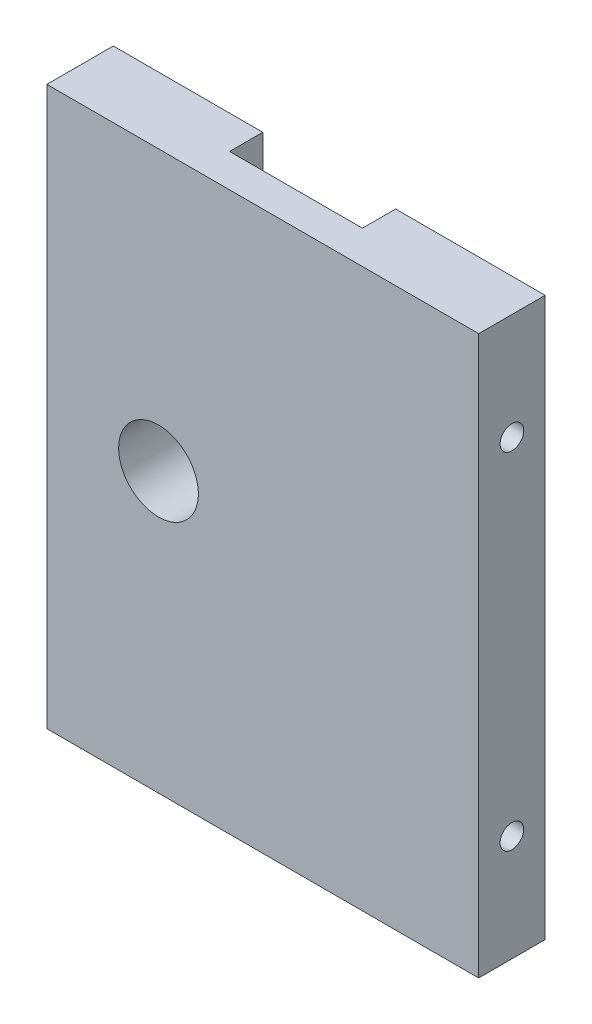
ISO-10303-21;
HEADER;
FILE_DESCRIPTION(('STEP AP214'),'2;1');
FILE_NAME('part.step','',(''),(''),'','','');
FILE_SCHEMA(('AUTOMOTIVE_DESIGN { 1 0 10303 214 1 1 1 1 }'));
ENDSEC;
DATA;
#1=APPLICATION_CONTEXT('core data for automotive mechanical design processes');
#2=APPLICATION_PROTOCOL_DEFINITION('international standard','automotive_design',2000,#1);
#3=PRODUCT_CONTEXT('',#1,'mechanical');
#4=PRODUCT('Part','Part','',(#3));
#5=PRODUCT_RELATED_PRODUCT_CATEGORY('part','',(#4));
#6=PRODUCT_DEFINITION_FORMATION('','',#4);
#7=PRODUCT_DEFINITION_CONTEXT('part definition',#1,'design');
#8=PRODUCT_DEFINITION('design','',#6,#7);
#9=PRODUCT_DEFINITION_SHAPE('','',#8);
#10=(LENGTH_UNIT() NAMED_UNIT(*) SI_UNIT(.MILLI.,.METRE.));
#11=(NAMED_UNIT(*) PLANE_ANGLE_UNIT() SI_UNIT($,.RADIAN.));
#12=(NAMED_UNIT(*) SI_UNIT($,.STERADIAN.) SOLID_ANGLE_UNIT());
#13=UNCERTAINTY_MEASURE_WITH_UNIT(LENGTH_MEASURE(1.E-05),#10,'distance_accuracy_value','');
#14=(GEOMETRIC_REPRESENTATION_CONTEXT(3) GLOBAL_UNCERTAINTY_ASSIGNED_CONTEXT((#13)) GLOBAL_UNIT_ASSIGNED_CONTEXT((#10,
#11,#12)) REPRESENTATION_CONTEXT('',''));
#15=CARTESIAN_POINT('',(0.,0.,0.));
#16=DIRECTION('',(0.,0.,1.));
#17=DIRECTION('',(1.,0.,0.));
#18=AXIS2_PLACEMENT_3D('',#15,#16,#17);
#19=CARTESIAN_POINT('',(0.,42.,5.));
#20=DIRECTION('',(0.,-1.,0.));
#21=DIRECTION('',(0.,0.,-1.));
#22=AXIS2_PLACEMENT_3D('',#19,#20,#21);
#23=PLANE('',#22);
#24=DIRECTION('',(0.,0.,-1.));
#25=VECTOR('',#24,1.);
#26=CARTESIAN_POINT('',(21.25,42.,2.5));
#27=LINE('',#26,#25);
#28=CARTESIAN_POINT('',(21.25,42.,2.5));
#29=VERTEX_POINT('',#28);
#30=CARTESIAN_POINT('',(21.25,42.,0.));
#31=VERTEX_POINT('',#30);
#32=EDGE_CURVE('E158',#29,#31,#27,.T.);
#33=ORIENTED_EDGE('',*,*,#32,.F.);
#34=DIRECTION('',(1.,0.,0.));
#35=VECTOR('',#34,1.);
#36=CARTESIAN_POINT('',(0.,42.,2.5));
#37=LINE('',#36,#35);
#38=CARTESIAN_POINT('',(11.25,42.,2.5));
#39=VERTEX_POINT('',#38);
#40=EDGE_CURVE('E143',#39,#29,#37,.T.);
#41=ORIENTED_EDGE('',*,*,#40,.F.);
#42=DIRECTION('',(0.,0.,-1.));
#43=VECTOR('',#42,1.);
#44=CARTESIAN_POINT('',(11.25,42.,2.5));
#45=LINE('',#44,#43);
#46=CARTESIAN_POINT('',(11.25,42.,0.));
#47=VERTEX_POINT('',#46);
#48=EDGE_CURVE('E161',#39,#47,#45,.T.);
#49=ORIENTED_EDGE('',*,*,#48,.T.);
#50=DIRECTION('',(-1.,0.,0.));
#51=VECTOR('',#50,1.);
#52=CARTESIAN_POINT('',(0.,42.,0.));
#53=LINE('',#52,#51);
#54=CARTESIAN_POINT('',(0.,42.,0.));
#55=VERTEX_POINT('',#54);
#56=EDGE_CURVE('E87',#47,#55,#53,.T.);
#57=ORIENTED_EDGE('',*,*,#56,.T.);
#58=DIRECTION('',(0.,0.,-1.));
#59=VECTOR('',#58,1.);
#60=CARTESIAN_POINT('',(0.,42.,5.));
#61=LINE('',#60,#59);
#62=CARTESIAN_POINT('',(0.,42.,5.));
#63=VERTEX_POINT('',#62);
#64=EDGE_CURVE('E201',#63,#55,#61,.T.);
#65=ORIENTED_EDGE('',*,*,#64,.F.);
#66=DIRECTION('',(-1.,0.,0.));
#67=VECTOR('',#66,1.);
#68=CARTESIAN_POINT('',(0.,42.,5.));
#69=LINE('',#68,#67);
#70=CARTESIAN_POINT('',(32.5,42.,5.));
#71=VERTEX_POINT('',#70);
#72=EDGE_CURVE('E66',#71,#63,#69,.T.);
#73=ORIENTED_EDGE('',*,*,#72,.F.);
#74=DIRECTION('',(0.,0.,-1.));
#75=VECTOR('',#74,1.);
#76=CARTESIAN_POINT('',(32.5,42.,5.));
#77=LINE('',#76,#75);
#78=CARTESIAN_POINT('',(32.5,42.,0.));
#79=VERTEX_POINT('',#78);
#80=EDGE_CURVE('E211',#71,#79,#77,.T.);
#81=ORIENTED_EDGE('',*,*,#80,.T.);
#82=EDGE_CURVE('E196',#79,#31,#53,.T.);
#83=ORIENTED_EDGE('',*,*,#82,.T.);
#84=EDGE_LOOP('',(#33,#41,#49,#57,#65,#73,#81,#83));
#85=FACE_BOUND('',#84,.T.);
#86=ADVANCED_FACE('F42',(#85),#23,.F.);
#87=CARTESIAN_POINT('',(0.,0.,0.));
#88=DIRECTION('',(0.,0.,-1.));
#89=DIRECTION('',(-1.,0.,0.));
#90=AXIS2_PLACEMENT_3D('',#87,#88,#89);
#91=PLANE('',#90);
#92=CARTESIAN_POINT('',(8.4,21.,0.));
#93=DIRECTION('',(0.,0.,-1.));
#94=DIRECTION('',(-1.,0.,0.));
#95=AXIS2_PLACEMENT_3D('',#92,#93,#94);
#96=CIRCLE('',#95,3.);
#97=CARTESIAN_POINT('',(5.4,21.,0.));
#98=VERTEX_POINT('',#97);
#99=EDGE_CURVE('E160',#98,#98,#96,.T.);
#100=ORIENTED_EDGE('',*,*,#99,.F.);
#101=EDGE_LOOP('',(#100));
#102=FACE_BOUND('',#101,.T.);
#103=DIRECTION('',(1.,0.,0.));
#104=VECTOR('',#103,1.);
#105=CARTESIAN_POINT('',(0.,35.5,0.));
#106=LINE('',#105,#104);
#107=CARTESIAN_POINT('',(11.25,35.5,0.));
#108=VERTEX_POINT('',#107);
#109=CARTESIAN_POINT('',(21.25,35.5,0.));
#110=VERTEX_POINT('',#109);
#111=EDGE_CURVE('E151',#108,#110,#106,.T.);
#112=ORIENTED_EDGE('',*,*,#111,.T.);
#113=DIRECTION('',(0.,1.,0.));
#114=VECTOR('',#113,1.);
#115=CARTESIAN_POINT('',(21.25,0.,0.));
#116=LINE('',#115,#114);
#117=EDGE_CURVE('E57',#110,#31,#116,.T.);
#118=ORIENTED_EDGE('',*,*,#117,.T.);
#119=ORIENTED_EDGE('',*,*,#82,.F.);
#120=DIRECTION('',(0.,1.,0.));
#121=VECTOR('',#120,1.);
#122=CARTESIAN_POINT('',(32.5,0.,0.));
#123=LINE('',#122,#121);
#124=CARTESIAN_POINT('',(32.5,0.,0.));
#125=VERTEX_POINT('',#124);
#126=EDGE_CURVE('E206',#125,#79,#123,.T.);
#127=ORIENTED_EDGE('',*,*,#126,.F.);
#128=DIRECTION('',(1.,0.,0.));
#129=VECTOR('',#128,1.);
#130=CARTESIAN_POINT('',(0.,0.,0.));
#131=LINE('',#130,#129);
#132=CARTESIAN_POINT('',(0.,0.,0.));
#133=VERTEX_POINT('',#132);
#134=EDGE_CURVE('E204',#133,#125,#131,.T.);
#135=ORIENTED_EDGE('',*,*,#134,.F.);
#136=DIRECTION('',(0.,-1.,0.));
#137=VECTOR('',#136,1.);
#138=CARTESIAN_POINT('',(0.,0.,0.));
#139=LINE('',#138,#137);
#140=EDGE_CURVE('E193',#55,#133,#139,.T.);
#141=ORIENTED_EDGE('',*,*,#140,.F.);
#142=ORIENTED_EDGE('',*,*,#56,.F.);
#143=DIRECTION('',(0.,-1.,0.));
#144=VECTOR('',#143,1.);
#145=CARTESIAN_POINT('',(11.25,0.,0.));
#146=LINE('',#145,#144);
#147=EDGE_CURVE('E148',#47,#108,#146,.T.);
#148=ORIENTED_EDGE('',*,*,#147,.T.);
#149=EDGE_LOOP('',(#112,#118,#119,#127,#135,#141,#142,#148));
#150=FACE_BOUND('',#149,.T.);
#151=ADVANCED_FACE('F221',(#102,#150),#91,.T.);
#152=CARTESIAN_POINT('',(0.,0.,5.));
#153=DIRECTION('',(1.,0.,0.));
#154=DIRECTION('',(0.,0.,-1.));
#155=AXIS2_PLACEMENT_3D('',#152,#153,#154);
#156=PLANE('',#155);
#157=CARTESIAN_POINT('',(0.,34.,2.5));
#158=DIRECTION('',(-1.,0.,0.));
#159=DIRECTION('',(0.,0.,1.));
#160=AXIS2_PLACEMENT_3D('',#157,#158,#159);
#161=CIRCLE('',#160,0.889000000000001);
#162=CARTESIAN_POINT('',(0.,34.,3.389));
#163=VERTEX_POINT('',#162);
#164=EDGE_CURVE('E181',#163,#163,#161,.T.);
#165=ORIENTED_EDGE('',*,*,#164,.F.);
#166=EDGE_LOOP('',(#165));
#167=FACE_BOUND('',#166,.T.);
#168=CARTESIAN_POINT('',(0.,8.,2.5));
#169=DIRECTION('',(-1.,0.,0.));
#170=DIRECTION('',(0.,0.,1.));
#171=AXIS2_PLACEMENT_3D('',#168,#169,#170);
#172=CIRCLE('',#171,0.888999999999999);
#173=CARTESIAN_POINT('',(0.,8.,3.389));
#174=VERTEX_POINT('',#173);
#175=EDGE_CURVE('E187',#174,#174,#172,.T.);
#176=ORIENTED_EDGE('',*,*,#175,.F.);
#177=EDGE_LOOP('',(#176));
#178=FACE_BOUND('',#177,.T.);
#179=ORIENTED_EDGE('',*,*,#140,.T.);
#180=DIRECTION('',(0.,0.,-1.));
#181=VECTOR('',#180,1.);
#182=CARTESIAN_POINT('',(0.,0.,5.));
#183=LINE('',#182,#181);
#184=CARTESIAN_POINT('',(0.,0.,5.));
#185=VERTEX_POINT('',#184);
#186=EDGE_CURVE('E11',#185,#133,#183,.T.);
#187=ORIENTED_EDGE('',*,*,#186,.F.);
#188=DIRECTION('',(0.,-1.,0.));
#189=VECTOR('',#188,1.);
#190=CARTESIAN_POINT('',(0.,0.,5.));
#191=LINE('',#190,#189);
#192=EDGE_CURVE('E194',#63,#185,#191,.T.);
#193=ORIENTED_EDGE('',*,*,#192,.F.);
#194=ORIENTED_EDGE('',*,*,#64,.T.);
#195=EDGE_LOOP('',(#179,#187,#193,#194));
#196=FACE_BOUND('',#195,.T.);
#197=ADVANCED_FACE('F44',(#167,#178,#196),#156,.F.);
#198=CARTESIAN_POINT('',(0.,0.,5.));
#199=DIRECTION('',(0.,1.,0.));
#200=DIRECTION('',(0.,0.,1.));
#201=AXIS2_PLACEMENT_3D('',#198,#199,#200);
#202=PLANE('',#201);
#203=ORIENTED_EDGE('',*,*,#134,.T.);
#204=DIRECTION('',(0.,0.,-1.));
#205=VECTOR('',#204,1.);
#206=CARTESIAN_POINT('',(32.5,0.,5.));
#207=LINE('',#206,#205);
#208=CARTESIAN_POINT('',(32.5,0.,5.));
#209=VERTEX_POINT('',#208);
#210=EDGE_CURVE('E50',#209,#125,#207,.T.);
#211=ORIENTED_EDGE('',*,*,#210,.F.);
#212=DIRECTION('',(1.,0.,0.));
#213=VECTOR('',#212,1.);
#214=CARTESIAN_POINT('',(0.,0.,5.));
#215=LINE('',#214,#213);
#216=EDGE_CURVE('E94',#185,#209,#215,.T.);
#217=ORIENTED_EDGE('',*,*,#216,.F.);
#218=ORIENTED_EDGE('',*,*,#186,.T.);
#219=EDGE_LOOP('',(#203,#211,#217,#218));
#220=FACE_BOUND('',#219,.T.);
#221=ADVANCED_FACE('F238',(#220),#202,.F.);
#222=CARTESIAN_POINT('',(32.5,0.,5.));
#223=DIRECTION('',(-1.,0.,0.));
#224=DIRECTION('',(0.,0.,1.));
#225=AXIS2_PLACEMENT_3D('',#222,#223,#224);
#226=PLANE('',#225);
#227=CARTESIAN_POINT('',(32.5,34.,2.5));
#228=DIRECTION('',(1.,0.,0.));
#229=DIRECTION('',(0.,0.,-1.));
#230=AXIS2_PLACEMENT_3D('',#227,#228,#229);
#231=CIRCLE('',#230,0.888999999999987);
#232=CARTESIAN_POINT('',(32.5,34.,1.61100000000001));
#233=VERTEX_POINT('',#232);
#234=EDGE_CURVE('E167',#233,#233,#231,.T.);
#235=ORIENTED_EDGE('',*,*,#234,.F.);
#236=EDGE_LOOP('',(#235));
#237=FACE_BOUND('',#236,.T.);
#238=CARTESIAN_POINT('',(32.5,8.,2.5));
#239=DIRECTION('',(1.,0.,0.));
#240=DIRECTION('',(0.,0.,-1.));
#241=AXIS2_PLACEMENT_3D('',#238,#239,#240);
#242=CIRCLE('',#241,0.888999999999989);
#243=CARTESIAN_POINT('',(32.5,8.,1.61100000000001));
#244=VERTEX_POINT('',#243);
#245=EDGE_CURVE('E175',#244,#244,#242,.T.);
#246=ORIENTED_EDGE('',*,*,#245,.F.);
#247=EDGE_LOOP('',(#246));
#248=FACE_BOUND('',#247,.T.);
#249=ORIENTED_EDGE('',*,*,#126,.T.);
#250=ORIENTED_EDGE('',*,*,#80,.F.);
#251=DIRECTION('',(0.,1.,0.));
#252=VECTOR('',#251,1.);
#253=CARTESIAN_POINT('',(32.5,0.,5.));
#254=LINE('',#253,#252);
#255=EDGE_CURVE('E198',#209,#71,#254,.T.);
#256=ORIENTED_EDGE('',*,*,#255,.F.);
#257=ORIENTED_EDGE('',*,*,#210,.T.);
#258=EDGE_LOOP('',(#249,#250,#256,#257));
#259=FACE_BOUND('',#258,.T.);
#260=ADVANCED_FACE('F217',(#237,#248,#259),#226,.F.);
#261=CARTESIAN_POINT('',(0.,0.,5.));
#262=DIRECTION('',(0.,0.,-1.));
#263=DIRECTION('',(-1.,0.,0.));
#264=AXIS2_PLACEMENT_3D('',#261,#262,#263);
#265=PLANE('',#264);
#266=CARTESIAN_POINT('',(8.4,21.,5.));
#267=DIRECTION('',(0.,0.,-1.));
#268=DIRECTION('',(-1.,0.,0.));
#269=AXIS2_PLACEMENT_3D('',#266,#267,#268);
#270=CIRCLE('',#269,3.);
#271=CARTESIAN_POINT('',(5.4,21.,5.));
#272=VERTEX_POINT('',#271);
#273=EDGE_CURVE('E164',#272,#272,#270,.T.);
#274=ORIENTED_EDGE('',*,*,#273,.T.);
#275=EDGE_LOOP('',(#274));
#276=FACE_BOUND('',#275,.T.);
#277=ORIENTED_EDGE('',*,*,#192,.T.);
#278=ORIENTED_EDGE('',*,*,#216,.T.);
#279=ORIENTED_EDGE('',*,*,#255,.T.);
#280=ORIENTED_EDGE('',*,*,#72,.T.);
#281=EDGE_LOOP('',(#277,#278,#279,#280));
#282=FACE_BOUND('',#281,.T.);
#283=ADVANCED_FACE('F226',(#276,#282),#265,.F.);
#284=CARTESIAN_POINT('',(7.4658349096845,8.,2.5));
#285=DIRECTION('',(-1.,0.,0.));
#286=DIRECTION('',(0.,0.,1.));
#287=AXIS2_PLACEMENT_3D('',#284,#285,#286);
#288=CONICAL_SURFACE('',#287,0.888999999999999,1.02974425867665);
#289=CARTESIAN_POINT('',(8.,8.,2.5));
#290=VERTEX_POINT('',#289);
#291=VERTEX_LOOP('',#290);
#292=FACE_BOUND('',#291,.T.);
#293=CARTESIAN_POINT('',(7.4658349096845,8.,2.5));
#294=DIRECTION('',(-1.,0.,0.));
#295=DIRECTION('',(0.,0.,1.));
#296=AXIS2_PLACEMENT_3D('',#293,#294,#295);
#297=CIRCLE('',#296,0.888999999999999);
#298=CARTESIAN_POINT('',(7.4658349096845,8.,3.389));
#299=VERTEX_POINT('',#298);
#300=EDGE_CURVE('E190',#299,#299,#297,.T.);
#301=ORIENTED_EDGE('',*,*,#300,.T.);
#302=EDGE_LOOP('',(#301));
#303=FACE_BOUND('',#302,.T.);
#304=ADVANCED_FACE('F228',(#292,#303),#288,.F.);
#305=CARTESIAN_POINT('',(0.,8.,2.5));
#306=DIRECTION('',(-1.,0.,0.));
#307=DIRECTION('',(0.,0.,1.));
#308=AXIS2_PLACEMENT_3D('',#305,#306,#307);
#309=CYLINDRICAL_SURFACE('',#308,0.888999999999999);
#310=ORIENTED_EDGE('',*,*,#300,.F.);
#311=EDGE_LOOP('',(#310));
#312=FACE_BOUND('',#311,.T.);
#313=ORIENTED_EDGE('',*,*,#175,.T.);
#314=EDGE_LOOP('',(#313));
#315=FACE_BOUND('',#314,.T.);
#316=ADVANCED_FACE('F235',(#312,#315),#309,.F.);
#317=CARTESIAN_POINT('',(7.4658349096845,34.,2.5));
#318=DIRECTION('',(-1.,0.,0.));
#319=DIRECTION('',(0.,0.,1.));
#320=AXIS2_PLACEMENT_3D('',#317,#318,#319);
#321=CONICAL_SURFACE('',#320,0.889000000000001,1.02974425867665);
#322=CARTESIAN_POINT('',(8.,34.,2.5));
#323=VERTEX_POINT('',#322);
#324=VERTEX_LOOP('',#323);
#325=FACE_BOUND('',#324,.T.);
#326=CARTESIAN_POINT('',(7.4658349096845,34.,2.5));
#327=DIRECTION('',(-1.,0.,0.));
#328=DIRECTION('',(0.,0.,1.));
#329=AXIS2_PLACEMENT_3D('',#326,#327,#328);
#330=CIRCLE('',#329,0.889000000000001);
#331=CARTESIAN_POINT('',(7.4658349096845,34.,3.389));
#332=VERTEX_POINT('',#331);
#333=EDGE_CURVE('E184',#332,#332,#330,.T.);
#334=ORIENTED_EDGE('',*,*,#333,.T.);
#335=EDGE_LOOP('',(#334));
#336=FACE_BOUND('',#335,.T.);
#337=ADVANCED_FACE('F288',(#325,#336),#321,.F.);
#338=CARTESIAN_POINT('',(0.,34.,2.5));
#339=DIRECTION('',(-1.,0.,0.));
#340=DIRECTION('',(0.,0.,1.));
#341=AXIS2_PLACEMENT_3D('',#338,#339,#340);
#342=CYLINDRICAL_SURFACE('',#341,0.889000000000001);
#343=ORIENTED_EDGE('',*,*,#333,.F.);
#344=EDGE_LOOP('',(#343));
#345=FACE_BOUND('',#344,.T.);
#346=ORIENTED_EDGE('',*,*,#164,.T.);
#347=EDGE_LOOP('',(#346));
#348=FACE_BOUND('',#347,.T.);
#349=ADVANCED_FACE('F284',(#345,#348),#342,.F.);
#350=CARTESIAN_POINT('',(25.0341650903155,8.,2.5));
#351=DIRECTION('',(1.,0.,0.));
#352=DIRECTION('',(0.,0.,-1.));
#353=AXIS2_PLACEMENT_3D('',#350,#351,#352);
#354=CONICAL_SURFACE('',#353,0.888999999999999,1.02974425867665);
#355=CARTESIAN_POINT('',(24.5,8.,2.5));
#356=VERTEX_POINT('',#355);
#357=VERTEX_LOOP('',#356);
#358=FACE_BOUND('',#357,.T.);
#359=CARTESIAN_POINT('',(25.0341650903155,8.,2.5));
#360=DIRECTION('',(1.,0.,0.));
#361=DIRECTION('',(0.,0.,-1.));
#362=AXIS2_PLACEMENT_3D('',#359,#360,#361);
#363=CIRCLE('',#362,0.888999999999999);
#364=CARTESIAN_POINT('',(25.0341650903155,8.,1.611));
#365=VERTEX_POINT('',#364);
#366=EDGE_CURVE('E178',#365,#365,#363,.T.);
#367=ORIENTED_EDGE('',*,*,#366,.T.);
#368=EDGE_LOOP('',(#367));
#369=FACE_BOUND('',#368,.T.);
#370=ADVANCED_FACE('F280',(#358,#369),#354,.F.);
#371=CARTESIAN_POINT('',(32.5,8.,2.5));
#372=DIRECTION('',(1.,0.,0.));
#373=DIRECTION('',(0.,0.,-1.));
#374=AXIS2_PLACEMENT_3D('',#371,#372,#373);
#375=CYLINDRICAL_SURFACE('',#374,0.888999999999994);
#376=ORIENTED_EDGE('',*,*,#366,.F.);
#377=EDGE_LOOP('',(#376));
#378=FACE_BOUND('',#377,.T.);
#379=ORIENTED_EDGE('',*,*,#245,.T.);
#380=EDGE_LOOP('',(#379));
#381=FACE_BOUND('',#380,.T.);
#382=ADVANCED_FACE('F276',(#378,#381),#375,.F.);
#383=CARTESIAN_POINT('',(25.0341650903155,34.,2.5));
#384=DIRECTION('',(1.,0.,0.));
#385=DIRECTION('',(0.,0.,-1.));
#386=AXIS2_PLACEMENT_3D('',#383,#384,#385);
#387=CONICAL_SURFACE('',#386,0.889000000000001,1.02974425867665);
#388=CARTESIAN_POINT('',(24.5,34.,2.5));
#389=VERTEX_POINT('',#388);
#390=VERTEX_LOOP('',#389);
#391=FACE_BOUND('',#390,.T.);
#392=CARTESIAN_POINT('',(25.0341650903155,34.,2.5));
#393=DIRECTION('',(1.,0.,0.));
#394=DIRECTION('',(0.,0.,-1.));
#395=AXIS2_PLACEMENT_3D('',#392,#393,#394);
#396=CIRCLE('',#395,0.889000000000001);
#397=CARTESIAN_POINT('',(25.0341650903155,34.,1.611));
#398=VERTEX_POINT('',#397);
#399=EDGE_CURVE('E172',#398,#398,#396,.T.);
#400=ORIENTED_EDGE('',*,*,#399,.T.);
#401=EDGE_LOOP('',(#400));
#402=FACE_BOUND('',#401,.T.);
#403=ADVANCED_FACE('F272',(#391,#402),#387,.F.);
#404=CARTESIAN_POINT('',(32.5,34.,2.5));
#405=DIRECTION('',(1.,0.,0.));
#406=DIRECTION('',(0.,0.,-1.));
#407=AXIS2_PLACEMENT_3D('',#404,#405,#406);
#408=CYLINDRICAL_SURFACE('',#407,0.888999999999994);
#409=ORIENTED_EDGE('',*,*,#399,.F.);
#410=EDGE_LOOP('',(#409));
#411=FACE_BOUND('',#410,.T.);
#412=ORIENTED_EDGE('',*,*,#234,.T.);
#413=EDGE_LOOP('',(#412));
#414=FACE_BOUND('',#413,.T.);
#415=ADVANCED_FACE('F268',(#411,#414),#408,.F.);
#416=CARTESIAN_POINT('',(8.4,21.,5.));
#417=DIRECTION('',(0.,0.,-1.));
#418=DIRECTION('',(-1.,0.,0.));
#419=AXIS2_PLACEMENT_3D('',#416,#417,#418);
#420=CYLINDRICAL_SURFACE('',#419,3.);
#421=ORIENTED_EDGE('',*,*,#273,.F.);
#422=EDGE_LOOP('',(#421));
#423=FACE_BOUND('',#422,.T.);
#424=ORIENTED_EDGE('',*,*,#99,.T.);
#425=EDGE_LOOP('',(#424));
#426=FACE_BOUND('',#425,.T.);
#427=ADVANCED_FACE('F262',(#423,#426),#420,.F.);
#428=CARTESIAN_POINT('',(21.25,0.,2.5));
#429=DIRECTION('',(-1.,0.,0.));
#430=DIRECTION('',(0.,0.,1.));
#431=AXIS2_PLACEMENT_3D('',#428,#429,#430);
#432=PLANE('',#431);
#433=ORIENTED_EDGE('',*,*,#117,.F.);
#434=DIRECTION('',(0.,0.,-1.));
#435=VECTOR('',#434,1.);
#436=CARTESIAN_POINT('',(21.25,35.5,2.5));
#437=LINE('',#436,#435);
#438=CARTESIAN_POINT('',(21.25,35.5,2.5));
#439=VERTEX_POINT('',#438);
#440=EDGE_CURVE('E132',#439,#110,#437,.T.);
#441=ORIENTED_EDGE('',*,*,#440,.F.);
#442=DIRECTION('',(0.,1.,0.));
#443=VECTOR('',#442,1.);
#444=CARTESIAN_POINT('',(21.25,0.,2.5));
#445=LINE('',#444,#443);
#446=EDGE_CURVE('E139',#439,#29,#445,.T.);
#447=ORIENTED_EDGE('',*,*,#446,.T.);
#448=ORIENTED_EDGE('',*,*,#32,.T.);
#449=EDGE_LOOP('',(#433,#441,#447,#448));
#450=FACE_BOUND('',#449,.T.);
#451=ADVANCED_FACE('F141',(#450),#432,.T.);
#452=CARTESIAN_POINT('',(11.25,0.,2.5));
#453=DIRECTION('',(1.,0.,0.));
#454=DIRECTION('',(0.,0.,-1.));
#455=AXIS2_PLACEMENT_3D('',#452,#453,#454);
#456=PLANE('',#455);
#457=ORIENTED_EDGE('',*,*,#147,.F.);
#458=ORIENTED_EDGE('',*,*,#48,.F.);
#459=DIRECTION('',(0.,-1.,0.));
#460=VECTOR('',#459,1.);
#461=CARTESIAN_POINT('',(11.25,0.,2.5));
#462=LINE('',#461,#460);
#463=CARTESIAN_POINT('',(11.25,35.5,2.5));
#464=VERTEX_POINT('',#463);
#465=EDGE_CURVE('E138',#39,#464,#462,.T.);
#466=ORIENTED_EDGE('',*,*,#465,.T.);
#467=DIRECTION('',(0.,0.,-1.));
#468=VECTOR('',#467,1.);
#469=CARTESIAN_POINT('',(11.25,35.5,2.5));
#470=LINE('',#469,#468);
#471=EDGE_CURVE('E134',#464,#108,#470,.T.);
#472=ORIENTED_EDGE('',*,*,#471,.T.);
#473=EDGE_LOOP('',(#457,#458,#466,#472));
#474=FACE_BOUND('',#473,.T.);
#475=ADVANCED_FACE('F254',(#474),#456,.T.);
#476=CARTESIAN_POINT('',(0.,35.5,2.5));
#477=DIRECTION('',(0.,1.,0.));
#478=DIRECTION('',(0.,0.,1.));
#479=AXIS2_PLACEMENT_3D('',#476,#477,#478);
#480=PLANE('',#479);
#481=ORIENTED_EDGE('',*,*,#111,.F.);
#482=ORIENTED_EDGE('',*,*,#471,.F.);
#483=DIRECTION('',(1.,0.,0.));
#484=VECTOR('',#483,1.);
#485=CARTESIAN_POINT('',(0.,35.5,2.5));
#486=LINE('',#485,#484);
#487=EDGE_CURVE('E129',#464,#439,#486,.T.);
#488=ORIENTED_EDGE('',*,*,#487,.T.);
#489=ORIENTED_EDGE('',*,*,#440,.T.);
#490=EDGE_LOOP('',(#481,#482,#488,#489));
#491=FACE_BOUND('',#490,.T.);
#492=ADVANCED_FACE('F131',(#491),#480,.T.);
#493=CARTESIAN_POINT('',(0.,0.,2.5));
#494=DIRECTION('',(0.,0.,-1.));
#495=DIRECTION('',(-1.,0.,0.));
#496=AXIS2_PLACEMENT_3D('',#493,#494,#495);
#497=PLANE('',#496);
#498=ORIENTED_EDGE('',*,*,#446,.F.);
#499=ORIENTED_EDGE('',*,*,#487,.F.);
#500=ORIENTED_EDGE('',*,*,#465,.F.);
#501=ORIENTED_EDGE('',*,*,#40,.T.);
#502=EDGE_LOOP('',(#498,#499,#500,#501));
#503=FACE_BOUND('',#502,.T.);
#504=ADVANCED_FACE('F145',(#503),#497,.T.);
#505=CLOSED_SHELL('',(#86,#151,#197,#221,#260,#283,#304,#316,#337,#349,#370,#382,#403,#415,#427,
#451,#475,#492,#504));
#506=MANIFOLD_SOLID_BREP('B2',#505);
#507=ADVANCED_BREP_SHAPE_REPRESENTATION('',(#18,#506),#14);
#508=SHAPE_DEFINITION_REPRESENTATION(#9,#507);
ENDSEC;
END-ISO-10303-21;
